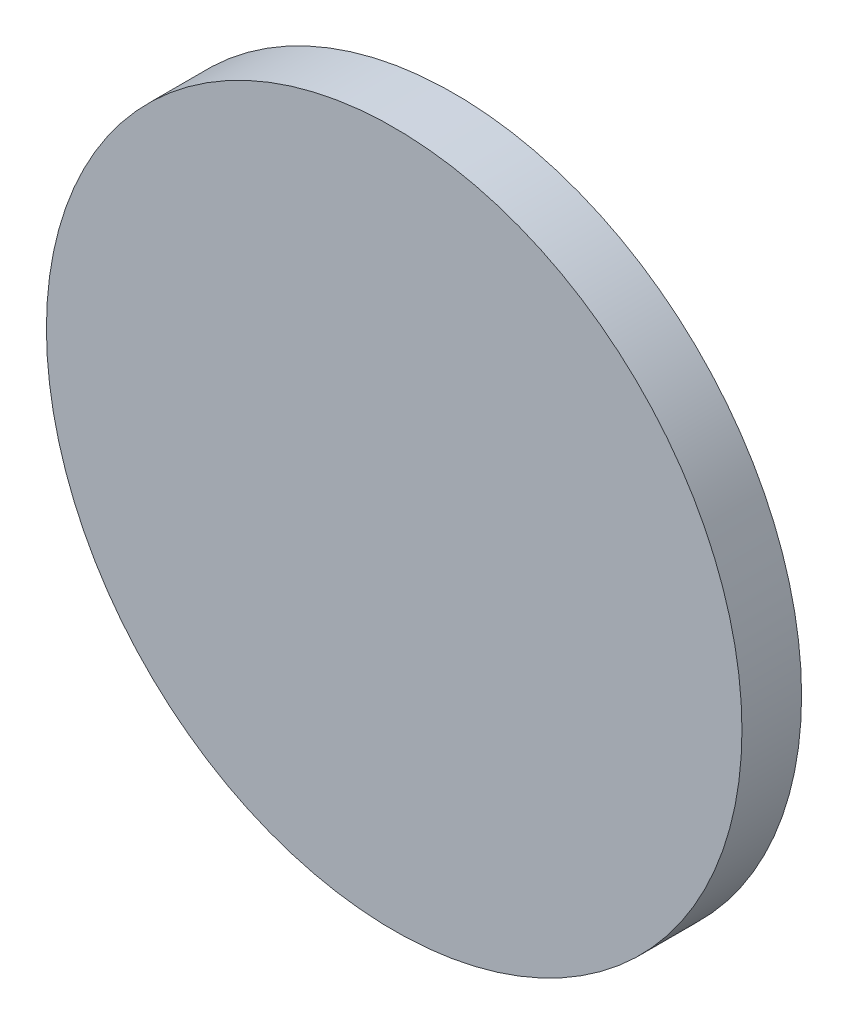
ISO-10303-21;
HEADER;
FILE_DESCRIPTION(('STEP AP214'),'2;1');
FILE_NAME('part.step','',(''),(''),'','','');
FILE_SCHEMA(('AUTOMOTIVE_DESIGN { 1 0 10303 214 1 1 1 1 }'));
ENDSEC;
DATA;
#1=APPLICATION_CONTEXT('core data for automotive mechanical design processes');
#2=APPLICATION_PROTOCOL_DEFINITION('international standard','automotive_design',2000,#1);
#3=PRODUCT_CONTEXT('',#1,'mechanical');
#4=PRODUCT('Part','Part','',(#3));
#5=PRODUCT_RELATED_PRODUCT_CATEGORY('part','',(#4));
#6=PRODUCT_DEFINITION_FORMATION('','',#4);
#7=PRODUCT_DEFINITION_CONTEXT('part definition',#1,'design');
#8=PRODUCT_DEFINITION('design','',#6,#7);
#9=PRODUCT_DEFINITION_SHAPE('','',#8);
#10=(LENGTH_UNIT() NAMED_UNIT(*) SI_UNIT(.MILLI.,.METRE.));
#11=(NAMED_UNIT(*) PLANE_ANGLE_UNIT() SI_UNIT($,.RADIAN.));
#12=(NAMED_UNIT(*) SI_UNIT($,.STERADIAN.) SOLID_ANGLE_UNIT());
#13=UNCERTAINTY_MEASURE_WITH_UNIT(LENGTH_MEASURE(1.E-05),#10,'distance_accuracy_value','');
#14=(GEOMETRIC_REPRESENTATION_CONTEXT(3) GLOBAL_UNCERTAINTY_ASSIGNED_CONTEXT((#13)) GLOBAL_UNIT_ASSIGNED_CONTEXT((#10,
#11,#12)) REPRESENTATION_CONTEXT('',''));
#15=CARTESIAN_POINT('',(0.,0.,0.));
#16=DIRECTION('',(0.,0.,1.));
#17=DIRECTION('',(1.,0.,0.));
#18=AXIS2_PLACEMENT_3D('',#15,#16,#17);
#19=CARTESIAN_POINT('',(4.7752,4.5974,0.));
#20=DIRECTION('',(0.,0.,-1.));
#21=DIRECTION('',(-1.,0.,0.));
#22=AXIS2_PLACEMENT_3D('',#19,#20,#21);
#23=PLANE('',#22);
#24=CARTESIAN_POINT('',(4.7752,4.5974,0.));
#25=DIRECTION('',(0.,0.,1.));
#26=DIRECTION('',(1.,0.,0.));
#27=AXIS2_PLACEMENT_3D('',#24,#25,#26);
#28=CIRCLE('',#27,0.200024667);
#29=CARTESIAN_POINT('',(4.975224667,4.5974,0.));
#30=VERTEX_POINT('',#29);
#31=EDGE_CURVE('E18',#30,#30,#28,.T.);
#32=ORIENTED_EDGE('',*,*,#31,.F.);
#33=EDGE_LOOP('',(#32));
#34=FACE_BOUND('',#33,.T.);
#35=ADVANCED_FACE('F15',(#34),#23,.T.);
#36=CARTESIAN_POINT('',(4.7752,4.5974,0.));
#37=DIRECTION('',(0.,0.,1.));
#38=DIRECTION('',(1.,0.,0.));
#39=AXIS2_PLACEMENT_3D('',#36,#37,#38);
#40=CYLINDRICAL_SURFACE('',#39,0.200024667);
#41=CARTESIAN_POINT('',(4.7752,4.5974,0.03429));
#42=DIRECTION('',(0.,0.,1.));
#43=DIRECTION('',(1.,0.,0.));
#44=AXIS2_PLACEMENT_3D('',#41,#42,#43);
#45=CIRCLE('',#44,0.200024667);
#46=CARTESIAN_POINT('',(4.975224667,4.5974,0.03429));
#47=VERTEX_POINT('',#46);
#48=EDGE_CURVE('E10',#47,#47,#45,.T.);
#49=ORIENTED_EDGE('',*,*,#48,.F.);
#50=EDGE_LOOP('',(#49));
#51=FACE_BOUND('',#50,.T.);
#52=ORIENTED_EDGE('',*,*,#31,.T.);
#53=EDGE_LOOP('',(#52));
#54=FACE_BOUND('',#53,.T.);
#55=ADVANCED_FACE('F27',(#51,#54),#40,.T.);
#56=CARTESIAN_POINT('',(4.7752,4.5974,0.03429));
#57=DIRECTION('',(0.,0.,1.));
#58=DIRECTION('',(1.,0.,0.));
#59=AXIS2_PLACEMENT_3D('',#56,#57,#58);
#60=PLANE('',#59);
#61=ORIENTED_EDGE('',*,*,#48,.T.);
#62=EDGE_LOOP('',(#61));
#63=FACE_BOUND('',#62,.T.);
#64=ADVANCED_FACE('F34',(#63),#60,.T.);
#65=CLOSED_SHELL('',(#35,#55,#64));
#66=MANIFOLD_SOLID_BREP('B1',#65);
#67=ADVANCED_BREP_SHAPE_REPRESENTATION('',(#18,#66),#14);
#68=SHAPE_DEFINITION_REPRESENTATION(#9,#67);
ENDSEC;
END-ISO-10303-21;
